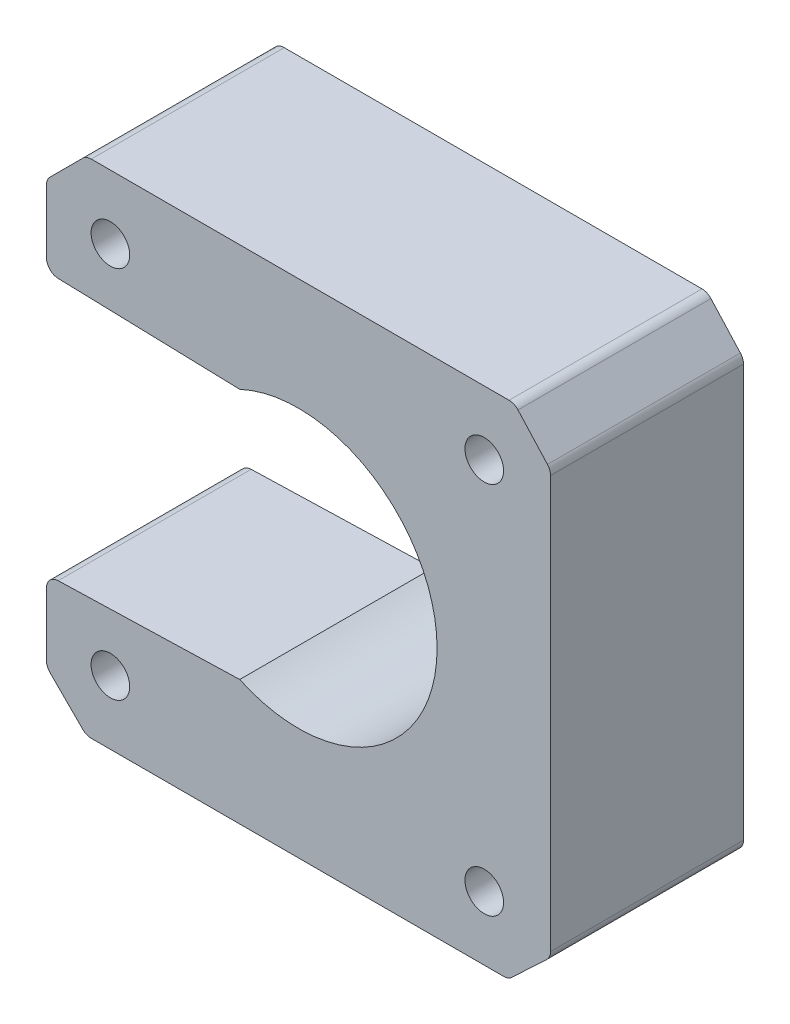
ISO-10303-21;
HEADER;
FILE_DESCRIPTION(('STEP AP214'),'2;1');
FILE_NAME('part.step','',(''),(''),'','','');
FILE_SCHEMA(('AUTOMOTIVE_DESIGN { 1 0 10303 214 1 1 1 1 }'));
ENDSEC;
DATA;
#1=APPLICATION_CONTEXT('core data for automotive mechanical design processes');
#2=APPLICATION_PROTOCOL_DEFINITION('international standard','automotive_design',2000,#1);
#3=PRODUCT_CONTEXT('',#1,'mechanical');
#4=PRODUCT('Part','Part','',(#3));
#5=PRODUCT_RELATED_PRODUCT_CATEGORY('part','',(#4));
#6=PRODUCT_DEFINITION_FORMATION('','',#4);
#7=PRODUCT_DEFINITION_CONTEXT('part definition',#1,'design');
#8=PRODUCT_DEFINITION('design','',#6,#7);
#9=PRODUCT_DEFINITION_SHAPE('','',#8);
#10=(LENGTH_UNIT() NAMED_UNIT(*) SI_UNIT(.MILLI.,.METRE.));
#11=(NAMED_UNIT(*) PLANE_ANGLE_UNIT() SI_UNIT($,.RADIAN.));
#12=(NAMED_UNIT(*) SI_UNIT($,.STERADIAN.) SOLID_ANGLE_UNIT());
#13=UNCERTAINTY_MEASURE_WITH_UNIT(LENGTH_MEASURE(1.E-05),#10,'distance_accuracy_value','');
#14=(GEOMETRIC_REPRESENTATION_CONTEXT(3) GLOBAL_UNCERTAINTY_ASSIGNED_CONTEXT((#13)) GLOBAL_UNIT_ASSIGNED_CONTEXT((#10,
#11,#12)) REPRESENTATION_CONTEXT('',''));
#15=CARTESIAN_POINT('',(0.,0.,0.));
#16=DIRECTION('',(0.,0.,1.));
#17=DIRECTION('',(1.,0.,0.));
#18=AXIS2_PLACEMENT_3D('',#15,#16,#17);
#19=CARTESIAN_POINT('',(1.20000000298024,38.0857864376269,0.));
#20=DIRECTION('',(0.,0.,-1.));
#21=DIRECTION('',(-1.,0.,0.));
#22=AXIS2_PLACEMENT_3D('',#19,#20,#21);
#23=CYLINDRICAL_SURFACE('',#22,1.00000000000001);
#24=CARTESIAN_POINT('',(1.20000000298024,38.0857864376269,-16.));
#25=DIRECTION('',(0.,0.,-1.));
#26=DIRECTION('',(-1.,0.,0.));
#27=AXIS2_PLACEMENT_3D('',#24,#25,#26);
#28=CIRCLE('',#27,1.00000000000001);
#29=CARTESIAN_POINT('',(0.200000002980233,38.0857864376269,-16.));
#30=VERTEX_POINT('',#29);
#31=CARTESIAN_POINT('',(0.492893221793694,38.7928932188134,-16.));
#32=VERTEX_POINT('',#31);
#33=EDGE_CURVE('E317',#30,#32,#28,.T.);
#34=ORIENTED_EDGE('',*,*,#33,.F.);
#35=DIRECTION('',(0.,0.,1.));
#36=VECTOR('',#35,1.);
#37=CARTESIAN_POINT('',(0.200000002980233,38.0857864376269,0.));
#38=LINE('',#37,#36);
#39=CARTESIAN_POINT('',(0.200000002980231,38.0857864376269,0.));
#40=VERTEX_POINT('',#39);
#41=EDGE_CURVE('E169',#40,#30,#38,.F.);
#42=ORIENTED_EDGE('',*,*,#41,.F.);
#43=CARTESIAN_POINT('',(1.20000000298024,38.0857864376269,0.));
#44=DIRECTION('',(0.,0.,-1.));
#45=DIRECTION('',(-1.,0.,0.));
#46=AXIS2_PLACEMENT_3D('',#43,#44,#45);
#47=CIRCLE('',#46,1.00000000000001);
#48=CARTESIAN_POINT('',(0.492893221793693,38.7928932188134,0.));
#49=VERTEX_POINT('',#48);
#50=EDGE_CURVE('E19',#40,#49,#47,.T.);
#51=ORIENTED_EDGE('',*,*,#50,.T.);
#52=DIRECTION('',(0.,0.,1.));
#53=VECTOR('',#52,1.);
#54=CARTESIAN_POINT('',(0.492893221793678,38.7928932188134,0.));
#55=LINE('',#54,#53);
#56=EDGE_CURVE('E168',#32,#49,#55,.T.);
#57=ORIENTED_EDGE('',*,*,#56,.F.);
#58=EDGE_LOOP('',(#34,#42,#51,#57));
#59=FACE_BOUND('',#58,.T.);
#60=ADVANCED_FACE('F16',(#59),#23,.T.);
#61=CARTESIAN_POINT('',(3.91421356237309,40.7999999970199,0.));
#62=DIRECTION('',(0.,0.,-1.));
#63=DIRECTION('',(-1.,0.,0.));
#64=AXIS2_PLACEMENT_3D('',#61,#62,#63);
#65=CYLINDRICAL_SURFACE('',#64,0.999999999999935);
#66=CARTESIAN_POINT('',(3.91421356237309,40.7999999970199,-16.));
#67=DIRECTION('',(0.,0.,-1.));
#68=DIRECTION('',(-1.,0.,0.));
#69=AXIS2_PLACEMENT_3D('',#66,#67,#68);
#70=CIRCLE('',#69,0.999999999999935);
#71=CARTESIAN_POINT('',(3.2071067811866,41.5071067782063,-16.));
#72=VERTEX_POINT('',#71);
#73=CARTESIAN_POINT('',(3.91421356237307,41.7999999970198,-16.));
#74=VERTEX_POINT('',#73);
#75=EDGE_CURVE('E315',#72,#74,#70,.T.);
#76=ORIENTED_EDGE('',*,*,#75,.F.);
#77=DIRECTION('',(0.,0.,1.));
#78=VECTOR('',#77,1.);
#79=CARTESIAN_POINT('',(3.20710678118657,41.5071067782063,0.));
#80=LINE('',#79,#78);
#81=CARTESIAN_POINT('',(3.20710678118659,41.5071067782063,0.));
#82=VERTEX_POINT('',#81);
#83=EDGE_CURVE('E249',#82,#72,#80,.F.);
#84=ORIENTED_EDGE('',*,*,#83,.F.);
#85=CARTESIAN_POINT('',(3.91421356237309,40.7999999970199,0.));
#86=DIRECTION('',(0.,0.,-1.));
#87=DIRECTION('',(-1.,0.,0.));
#88=AXIS2_PLACEMENT_3D('',#85,#86,#87);
#89=CIRCLE('',#88,0.999999999999935);
#90=CARTESIAN_POINT('',(3.91421356237307,41.7999999970198,0.));
#91=VERTEX_POINT('',#90);
#92=EDGE_CURVE('E171',#82,#91,#89,.T.);
#93=ORIENTED_EDGE('',*,*,#92,.T.);
#94=DIRECTION('',(0.,0.,1.));
#95=VECTOR('',#94,1.);
#96=CARTESIAN_POINT('',(3.91421356237304,41.7999999970198,0.));
#97=LINE('',#96,#95);
#98=EDGE_CURVE('E244',#74,#91,#97,.T.);
#99=ORIENTED_EDGE('',*,*,#98,.F.);
#100=EDGE_LOOP('',(#76,#84,#93,#99));
#101=FACE_BOUND('',#100,.T.);
#102=ADVANCED_FACE('F339',(#101),#65,.T.);
#103=CARTESIAN_POINT('',(38.5576301208605,40.7999999970198,0.));
#104=DIRECTION('',(0.,0.,-1.));
#105=DIRECTION('',(-1.,0.,0.));
#106=AXIS2_PLACEMENT_3D('',#103,#104,#105);
#107=CYLINDRICAL_SURFACE('',#106,1.00000000000001);
#108=CARTESIAN_POINT('',(38.5576301208605,40.7999999970198,-16.));
#109=DIRECTION('',(0.,0.,-1.));
#110=DIRECTION('',(-1.,0.,0.));
#111=AXIS2_PLACEMENT_3D('',#108,#109,#110);
#112=CIRCLE('',#111,1.00000000000001);
#113=CARTESIAN_POINT('',(38.5576301208605,41.7999999970198,-16.));
#114=VERTEX_POINT('',#113);
#115=CARTESIAN_POINT('',(39.2975701947855,41.4726727904341,-16.));
#116=VERTEX_POINT('',#115);
#117=EDGE_CURVE('E313',#114,#116,#112,.T.);
#118=ORIENTED_EDGE('',*,*,#117,.F.);
#119=DIRECTION('',(0.,0.,1.));
#120=VECTOR('',#119,1.);
#121=CARTESIAN_POINT('',(38.5576301208605,41.7999999970198,0.));
#122=LINE('',#121,#120);
#123=CARTESIAN_POINT('',(38.5576301208605,41.7999999970198,0.));
#124=VERTEX_POINT('',#123);
#125=EDGE_CURVE('E179',#124,#114,#122,.F.);
#126=ORIENTED_EDGE('',*,*,#125,.F.);
#127=CARTESIAN_POINT('',(38.5576301208605,40.7999999970198,0.));
#128=DIRECTION('',(0.,0.,-1.));
#129=DIRECTION('',(-1.,0.,0.));
#130=AXIS2_PLACEMENT_3D('',#127,#128,#129);
#131=CIRCLE('',#130,1.00000000000001);
#132=CARTESIAN_POINT('',(39.2975701947855,41.4726727904341,0.));
#133=VERTEX_POINT('',#132);
#134=EDGE_CURVE('E335',#124,#133,#131,.T.);
#135=ORIENTED_EDGE('',*,*,#134,.T.);
#136=DIRECTION('',(0.,0.,1.));
#137=VECTOR('',#136,1.);
#138=CARTESIAN_POINT('',(39.2975701947855,41.4726727904341,0.));
#139=LINE('',#138,#137);
#140=EDGE_CURVE('E238',#116,#133,#139,.T.);
#141=ORIENTED_EDGE('',*,*,#140,.F.);
#142=EDGE_LOOP('',(#118,#126,#135,#141));
#143=FACE_BOUND('',#142,.T.);
#144=ADVANCED_FACE('F349',(#143),#107,.T.);
#145=CARTESIAN_POINT('',(41.0000000000001,38.1133931257203,0.));
#146=DIRECTION('',(0.,0.,-1.));
#147=DIRECTION('',(-1.,0.,0.));
#148=AXIS2_PLACEMENT_3D('',#145,#146,#147);
#149=CYLINDRICAL_SURFACE('',#148,1.00000000000003);
#150=CARTESIAN_POINT('',(41.0000000000001,38.1133931257203,-16.));
#151=DIRECTION('',(0.,0.,-1.));
#152=DIRECTION('',(-1.,0.,0.));
#153=AXIS2_PLACEMENT_3D('',#150,#151,#152);
#154=CIRCLE('',#153,1.00000000000003);
#155=CARTESIAN_POINT('',(41.7399400739251,38.7860659191346,-16.));
#156=VERTEX_POINT('',#155);
#157=CARTESIAN_POINT('',(42.0000000000001,38.1133931257203,-16.));
#158=VERTEX_POINT('',#157);
#159=EDGE_CURVE('E311',#156,#158,#154,.T.);
#160=ORIENTED_EDGE('',*,*,#159,.F.);
#161=DIRECTION('',(0.,0.,1.));
#162=VECTOR('',#161,1.);
#163=CARTESIAN_POINT('',(41.7399400739251,38.7860659191346,0.));
#164=LINE('',#163,#162);
#165=CARTESIAN_POINT('',(41.7399400739251,38.7860659191346,0.));
#166=VERTEX_POINT('',#165);
#167=EDGE_CURVE('E242',#166,#156,#164,.F.);
#168=ORIENTED_EDGE('',*,*,#167,.F.);
#169=CARTESIAN_POINT('',(41.0000000000001,38.1133931257203,0.));
#170=DIRECTION('',(0.,0.,-1.));
#171=DIRECTION('',(-1.,0.,0.));
#172=AXIS2_PLACEMENT_3D('',#169,#170,#171);
#173=CIRCLE('',#172,1.00000000000003);
#174=CARTESIAN_POINT('',(42.0000000000001,38.1133931257203,0.));
#175=VERTEX_POINT('',#174);
#176=EDGE_CURVE('E333',#166,#175,#173,.T.);
#177=ORIENTED_EDGE('',*,*,#176,.T.);
#178=DIRECTION('',(0.,0.,1.));
#179=VECTOR('',#178,1.);
#180=CARTESIAN_POINT('',(42.0000000000001,38.1133931257202,0.));
#181=LINE('',#180,#179);
#182=EDGE_CURVE('E232',#158,#175,#181,.T.);
#183=ORIENTED_EDGE('',*,*,#182,.F.);
#184=EDGE_LOOP('',(#160,#168,#177,#183));
#185=FACE_BOUND('',#184,.T.);
#186=ADVANCED_FACE('F399',(#185),#149,.T.);
#187=CARTESIAN_POINT('',(41.,3.93154439693087,0.));
#188=DIRECTION('',(0.,0.,-1.));
#189=DIRECTION('',(-1.,0.,0.));
#190=AXIS2_PLACEMENT_3D('',#187,#188,#189);
#191=CYLINDRICAL_SURFACE('',#190,0.99999999999997);
#192=CARTESIAN_POINT('',(41.,3.93154439693087,-16.));
#193=DIRECTION('',(0.,0.,-1.));
#194=DIRECTION('',(-1.,0.,0.));
#195=AXIS2_PLACEMENT_3D('',#192,#193,#194);
#196=CIRCLE('',#195,0.99999999999997);
#197=CARTESIAN_POINT('',(41.9999999999999,3.93154439693087,-16.));
#198=VERTEX_POINT('',#197);
#199=CARTESIAN_POINT('',(41.686012868361,3.20395499043635,-16.));
#200=VERTEX_POINT('',#199);
#201=EDGE_CURVE('E309',#198,#200,#196,.T.);
#202=ORIENTED_EDGE('',*,*,#201,.F.);
#203=DIRECTION('',(0.,0.,1.));
#204=VECTOR('',#203,1.);
#205=CARTESIAN_POINT('',(41.9999999999999,3.93154439693088,0.));
#206=LINE('',#205,#204);
#207=CARTESIAN_POINT('',(42.,3.93154439693087,0.));
#208=VERTEX_POINT('',#207);
#209=EDGE_CURVE('E236',#208,#198,#206,.F.);
#210=ORIENTED_EDGE('',*,*,#209,.F.);
#211=CARTESIAN_POINT('',(41.,3.93154439693087,0.));
#212=DIRECTION('',(0.,0.,-1.));
#213=DIRECTION('',(-1.,0.,0.));
#214=AXIS2_PLACEMENT_3D('',#211,#212,#213);
#215=CIRCLE('',#214,0.99999999999997);
#216=CARTESIAN_POINT('',(41.686012868361,3.20395499043635,0.));
#217=VERTEX_POINT('',#216);
#218=EDGE_CURVE('E331',#208,#217,#215,.T.);
#219=ORIENTED_EDGE('',*,*,#218,.T.);
#220=DIRECTION('',(0.,0.,1.));
#221=VECTOR('',#220,1.);
#222=CARTESIAN_POINT('',(41.686012868361,3.20395499043634,0.));
#223=LINE('',#222,#221);
#224=EDGE_CURVE('E226',#200,#217,#223,.T.);
#225=ORIENTED_EDGE('',*,*,#224,.F.);
#226=EDGE_LOOP('',(#202,#210,#219,#225));
#227=FACE_BOUND('',#226,.T.);
#228=ADVANCED_FACE('F403',(#227),#191,.T.);
#229=CARTESIAN_POINT('',(38.1029074583451,1.20000000298024,0.));
#230=DIRECTION('',(0.,0.,-1.));
#231=DIRECTION('',(-1.,0.,0.));
#232=AXIS2_PLACEMENT_3D('',#229,#230,#231);
#233=CYLINDRICAL_SURFACE('',#232,1.00000000000001);
#234=CARTESIAN_POINT('',(38.1029074583451,1.20000000298024,-16.));
#235=DIRECTION('',(0.,0.,-1.));
#236=DIRECTION('',(-1.,0.,0.));
#237=AXIS2_PLACEMENT_3D('',#234,#235,#236);
#238=CIRCLE('',#237,1.00000000000001);
#239=CARTESIAN_POINT('',(38.7889203267061,0.472410596485713,-16.));
#240=VERTEX_POINT('',#239);
#241=CARTESIAN_POINT('',(38.1029074583451,0.200000002980231,-16.));
#242=VERTEX_POINT('',#241);
#243=EDGE_CURVE('E307',#240,#242,#238,.T.);
#244=ORIENTED_EDGE('',*,*,#243,.F.);
#245=DIRECTION('',(0.,0.,1.));
#246=VECTOR('',#245,1.);
#247=CARTESIAN_POINT('',(38.7889203267061,0.472410596485702,0.));
#248=LINE('',#247,#246);
#249=CARTESIAN_POINT('',(38.7889203267061,0.47241059648571,0.));
#250=VERTEX_POINT('',#249);
#251=EDGE_CURVE('E230',#250,#240,#248,.F.);
#252=ORIENTED_EDGE('',*,*,#251,.F.);
#253=CARTESIAN_POINT('',(38.1029074583451,1.20000000298024,0.));
#254=DIRECTION('',(0.,0.,-1.));
#255=DIRECTION('',(-1.,0.,0.));
#256=AXIS2_PLACEMENT_3D('',#253,#254,#255);
#257=CIRCLE('',#256,1.00000000000001);
#258=CARTESIAN_POINT('',(38.1029074583451,0.20000000298023,0.));
#259=VERTEX_POINT('',#258);
#260=EDGE_CURVE('E329',#250,#259,#257,.T.);
#261=ORIENTED_EDGE('',*,*,#260,.T.);
#262=DIRECTION('',(0.,0.,1.));
#263=VECTOR('',#262,1.);
#264=CARTESIAN_POINT('',(38.1029074583451,0.200000002980231,0.));
#265=LINE('',#264,#263);
#266=EDGE_CURVE('E220',#242,#259,#265,.T.);
#267=ORIENTED_EDGE('',*,*,#266,.F.);
#268=EDGE_LOOP('',(#244,#252,#261,#267));
#269=FACE_BOUND('',#268,.T.);
#270=ADVANCED_FACE('F411',(#269),#233,.T.);
#271=CARTESIAN_POINT('',(3.91421356237309,1.20000000298021,0.));
#272=DIRECTION('',(0.,0.,-1.));
#273=DIRECTION('',(-1.,0.,0.));
#274=AXIS2_PLACEMENT_3D('',#271,#272,#273);
#275=CYLINDRICAL_SURFACE('',#274,0.999999999999982);
#276=CARTESIAN_POINT('',(3.91421356237309,1.20000000298021,-16.));
#277=DIRECTION('',(0.,0.,-1.));
#278=DIRECTION('',(-1.,0.,0.));
#279=AXIS2_PLACEMENT_3D('',#276,#277,#278);
#280=CIRCLE('',#279,0.999999999999982);
#281=CARTESIAN_POINT('',(3.91421356237308,0.200000002980233,-16.));
#282=VERTEX_POINT('',#281);
#283=CARTESIAN_POINT('',(3.20710678118656,0.492893221793676,-16.));
#284=VERTEX_POINT('',#283);
#285=EDGE_CURVE('E305',#282,#284,#280,.T.);
#286=ORIENTED_EDGE('',*,*,#285,.F.);
#287=DIRECTION('',(0.,0.,1.));
#288=VECTOR('',#287,1.);
#289=CARTESIAN_POINT('',(3.91421356237307,0.200000002980233,0.));
#290=LINE('',#289,#288);
#291=CARTESIAN_POINT('',(3.91421356237308,0.200000002980231,0.));
#292=VERTEX_POINT('',#291);
#293=EDGE_CURVE('E224',#292,#282,#290,.F.);
#294=ORIENTED_EDGE('',*,*,#293,.F.);
#295=CARTESIAN_POINT('',(3.91421356237309,1.20000000298021,0.));
#296=DIRECTION('',(0.,0.,-1.));
#297=DIRECTION('',(-1.,0.,0.));
#298=AXIS2_PLACEMENT_3D('',#295,#296,#297);
#299=CIRCLE('',#298,0.999999999999982);
#300=CARTESIAN_POINT('',(3.20710678118656,0.492893221793676,0.));
#301=VERTEX_POINT('',#300);
#302=EDGE_CURVE('E327',#292,#301,#299,.T.);
#303=ORIENTED_EDGE('',*,*,#302,.T.);
#304=DIRECTION('',(0.,0.,1.));
#305=VECTOR('',#304,1.);
#306=CARTESIAN_POINT('',(3.20710678118656,0.492893221793676,0.));
#307=LINE('',#306,#305);
#308=EDGE_CURVE('E214',#284,#301,#307,.T.);
#309=ORIENTED_EDGE('',*,*,#308,.F.);
#310=EDGE_LOOP('',(#286,#294,#303,#309));
#311=FACE_BOUND('',#310,.T.);
#312=ADVANCED_FACE('F420',(#311),#275,.T.);
#313=CARTESIAN_POINT('',(1.20000000298022,3.91421356237309,0.));
#314=DIRECTION('',(0.,0.,-1.));
#315=DIRECTION('',(-1.,0.,0.));
#316=AXIS2_PLACEMENT_3D('',#313,#314,#315);
#317=CYLINDRICAL_SURFACE('',#316,0.99999999999999);
#318=CARTESIAN_POINT('',(1.20000000298022,3.91421356237309,-16.));
#319=DIRECTION('',(0.,0.,-1.));
#320=DIRECTION('',(-1.,0.,0.));
#321=AXIS2_PLACEMENT_3D('',#318,#319,#320);
#322=CIRCLE('',#321,0.99999999999999);
#323=CARTESIAN_POINT('',(0.492893221793689,3.20710678118655,-16.));
#324=VERTEX_POINT('',#323);
#325=CARTESIAN_POINT('',(0.200000002980232,3.91421356237309,-16.));
#326=VERTEX_POINT('',#325);
#327=EDGE_CURVE('E303',#324,#326,#322,.T.);
#328=ORIENTED_EDGE('',*,*,#327,.F.);
#329=DIRECTION('',(0.,0.,1.));
#330=VECTOR('',#329,1.);
#331=CARTESIAN_POINT('',(0.492893221793696,3.20710678118654,0.));
#332=LINE('',#331,#330);
#333=CARTESIAN_POINT('',(0.492893221793689,3.20710678118655,0.));
#334=VERTEX_POINT('',#333);
#335=EDGE_CURVE('E218',#334,#324,#332,.F.);
#336=ORIENTED_EDGE('',*,*,#335,.F.);
#337=CARTESIAN_POINT('',(1.20000000298022,3.91421356237309,0.));
#338=DIRECTION('',(0.,0.,-1.));
#339=DIRECTION('',(-1.,0.,0.));
#340=AXIS2_PLACEMENT_3D('',#337,#338,#339);
#341=CIRCLE('',#340,0.99999999999999);
#342=CARTESIAN_POINT('',(0.200000002980232,3.91421356237309,0.));
#343=VERTEX_POINT('',#342);
#344=EDGE_CURVE('E325',#334,#343,#341,.T.);
#345=ORIENTED_EDGE('',*,*,#344,.T.);
#346=DIRECTION('',(0.,0.,1.));
#347=VECTOR('',#346,1.);
#348=CARTESIAN_POINT('',(0.200000002980232,3.91421356237309,0.));
#349=LINE('',#348,#347);
#350=EDGE_CURVE('E208',#326,#343,#349,.T.);
#351=ORIENTED_EDGE('',*,*,#350,.F.);
#352=EDGE_LOOP('',(#328,#336,#345,#351));
#353=FACE_BOUND('',#352,.T.);
#354=ADVANCED_FACE('F429',(#353),#317,.T.);
#355=CARTESIAN_POINT('',(1.20000000298015,9.14879205829702,0.));
#356=DIRECTION('',(0.,0.,-1.));
#357=DIRECTION('',(-1.,0.,0.));
#358=AXIS2_PLACEMENT_3D('',#355,#356,#357);
#359=CYLINDRICAL_SURFACE('',#358,0.999999999999916);
#360=CARTESIAN_POINT('',(1.20000000298015,9.14879205829702,-16.));
#361=DIRECTION('',(0.,0.,-1.));
#362=DIRECTION('',(-1.,0.,0.));
#363=AXIS2_PLACEMENT_3D('',#360,#361,#362);
#364=CIRCLE('',#363,0.999999999999916);
#365=CARTESIAN_POINT('',(0.200000002980232,9.14879205829702,-16.));
#366=VERTEX_POINT('',#365);
#367=CARTESIAN_POINT('',(1.17131880358903,10.1483806680768,-16.));
#368=VERTEX_POINT('',#367);
#369=EDGE_CURVE('E256',#366,#368,#364,.T.);
#370=ORIENTED_EDGE('',*,*,#369,.F.);
#371=DIRECTION('',(0.,0.,1.));
#372=VECTOR('',#371,1.);
#373=CARTESIAN_POINT('',(0.200000002980232,9.14879205829702,0.));
#374=LINE('',#373,#372);
#375=CARTESIAN_POINT('',(0.200000002980233,9.14879205829702,0.));
#376=VERTEX_POINT('',#375);
#377=EDGE_CURVE('E212',#376,#366,#374,.F.);
#378=ORIENTED_EDGE('',*,*,#377,.F.);
#379=CARTESIAN_POINT('',(1.20000000298015,9.14879205829702,0.));
#380=DIRECTION('',(0.,0.,-1.));
#381=DIRECTION('',(-1.,0.,0.));
#382=AXIS2_PLACEMENT_3D('',#379,#380,#381);
#383=CIRCLE('',#382,0.999999999999916);
#384=CARTESIAN_POINT('',(1.17131880358903,10.1483806680768,0.));
#385=VERTEX_POINT('',#384);
#386=EDGE_CURVE('E323',#376,#385,#383,.T.);
#387=ORIENTED_EDGE('',*,*,#386,.T.);
#388=DIRECTION('',(0.,0.,1.));
#389=VECTOR('',#388,1.);
#390=CARTESIAN_POINT('',(1.17131880358907,10.1483806680768,0.));
#391=LINE('',#390,#389);
#392=EDGE_CURVE('E204',#368,#385,#391,.T.);
#393=ORIENTED_EDGE('',*,*,#392,.F.);
#394=EDGE_LOOP('',(#370,#378,#387,#393));
#395=FACE_BOUND('',#394,.T.);
#396=ADVANCED_FACE('F437',(#395),#359,.T.);
#397=CARTESIAN_POINT('',(1.20000000298022,32.851207941703,0.));
#398=DIRECTION('',(0.,0.,-1.));
#399=DIRECTION('',(-1.,0.,0.));
#400=AXIS2_PLACEMENT_3D('',#397,#398,#399);
#401=CYLINDRICAL_SURFACE('',#400,0.999999999999992);
#402=CARTESIAN_POINT('',(1.20000000298022,32.851207941703,-16.));
#403=DIRECTION('',(0.,0.,-1.));
#404=DIRECTION('',(-1.,0.,0.));
#405=AXIS2_PLACEMENT_3D('',#402,#403,#404);
#406=CIRCLE('',#405,0.999999999999992);
#407=CARTESIAN_POINT('',(1.17131880358905,31.8516193319232,-16.));
#408=VERTEX_POINT('',#407);
#409=CARTESIAN_POINT('',(0.20000000298023,32.851207941703,-16.));
#410=VERTEX_POINT('',#409);
#411=EDGE_CURVE('E319',#408,#410,#406,.T.);
#412=ORIENTED_EDGE('',*,*,#411,.F.);
#413=DIRECTION('',(0.,0.,1.));
#414=VECTOR('',#413,1.);
#415=CARTESIAN_POINT('',(1.17131880358905,31.8516193319232,0.));
#416=LINE('',#415,#414);
#417=CARTESIAN_POINT('',(1.17131880358905,31.8516193319233,0.));
#418=VERTEX_POINT('',#417);
#419=EDGE_CURVE('E198',#418,#408,#416,.F.);
#420=ORIENTED_EDGE('',*,*,#419,.F.);
#421=CARTESIAN_POINT('',(1.20000000298022,32.851207941703,0.));
#422=DIRECTION('',(0.,0.,-1.));
#423=DIRECTION('',(-1.,0.,0.));
#424=AXIS2_PLACEMENT_3D('',#421,#422,#423);
#425=CIRCLE('',#424,0.999999999999992);
#426=CARTESIAN_POINT('',(0.20000000298023,32.851207941703,0.));
#427=VERTEX_POINT('',#426);
#428=EDGE_CURVE('E321',#418,#427,#425,.T.);
#429=ORIENTED_EDGE('',*,*,#428,.T.);
#430=DIRECTION('',(0.,0.,1.));
#431=VECTOR('',#430,1.);
#432=CARTESIAN_POINT('',(0.20000000298023,32.851207941703,0.));
#433=LINE('',#432,#431);
#434=EDGE_CURVE('E251',#410,#427,#433,.T.);
#435=ORIENTED_EDGE('',*,*,#434,.F.);
#436=EDGE_LOOP('',(#412,#420,#429,#435));
#437=FACE_BOUND('',#436,.T.);
#438=ADVANCED_FACE('F360',(#437),#401,.T.);
#439=CARTESIAN_POINT('',(21.1000000014902,21.,-16.));
#440=DIRECTION('',(0.,0.,-1.));
#441=DIRECTION('',(-1.,0.,0.));
#442=AXIS2_PLACEMENT_3D('',#439,#440,#441);
#443=PLANE('',#442);
#444=CARTESIAN_POINT('',(5.5,36.5,-16.));
#445=DIRECTION('',(0.,0.,-1.));
#446=DIRECTION('',(-1.,0.,0.));
#447=AXIS2_PLACEMENT_3D('',#444,#445,#446);
#448=CIRCLE('',#447,1.6);
#449=CARTESIAN_POINT('',(3.9,36.5,-16.));
#450=VERTEX_POINT('',#449);
#451=EDGE_CURVE('E191',#450,#450,#448,.F.);
#452=ORIENTED_EDGE('',*,*,#451,.T.);
#453=EDGE_LOOP('',(#452));
#454=FACE_BOUND('',#453,.T.);
#455=CARTESIAN_POINT('',(36.5,36.5,-16.));
#456=DIRECTION('',(0.,0.,-1.));
#457=DIRECTION('',(-1.,0.,0.));
#458=AXIS2_PLACEMENT_3D('',#455,#456,#457);
#459=CIRCLE('',#458,1.60000000000001);
#460=CARTESIAN_POINT('',(34.9,36.5,-16.));
#461=VERTEX_POINT('',#460);
#462=EDGE_CURVE('E292',#461,#461,#459,.F.);
#463=ORIENTED_EDGE('',*,*,#462,.T.);
#464=EDGE_LOOP('',(#463));
#465=FACE_BOUND('',#464,.T.);
#466=CARTESIAN_POINT('',(5.5,5.5,-16.));
#467=DIRECTION('',(0.,0.,-1.));
#468=DIRECTION('',(-1.,0.,0.));
#469=AXIS2_PLACEMENT_3D('',#466,#467,#468);
#470=CIRCLE('',#469,1.6);
#471=CARTESIAN_POINT('',(3.9,5.5,-16.));
#472=VERTEX_POINT('',#471);
#473=EDGE_CURVE('E295',#472,#472,#470,.F.);
#474=ORIENTED_EDGE('',*,*,#473,.T.);
#475=EDGE_LOOP('',(#474));
#476=FACE_BOUND('',#475,.T.);
#477=CARTESIAN_POINT('',(36.5,5.5,-16.));
#478=DIRECTION('',(0.,0.,-1.));
#479=DIRECTION('',(-1.,0.,0.));
#480=AXIS2_PLACEMENT_3D('',#477,#478,#479);
#481=CIRCLE('',#480,1.60000000000001);
#482=CARTESIAN_POINT('',(34.9,5.5,-16.));
#483=VERTEX_POINT('',#482);
#484=EDGE_CURVE('E196',#483,#483,#481,.F.);
#485=ORIENTED_EDGE('',*,*,#484,.T.);
#486=EDGE_LOOP('',(#485));
#487=FACE_BOUND('',#486,.T.);
#488=DIRECTION('',(-0.999588609779786,-0.0286811993911593,0.));
#489=VECTOR('',#488,1.);
#490=CARTESIAN_POINT('',(1.17131880358907,10.1483806680768,-16.));
#491=LINE('',#490,#489);
#492=CARTESIAN_POINT('',(16.2242648728231,10.5802949010043,-16.));
#493=VERTEX_POINT('',#492);
#494=EDGE_CURVE('E207',#493,#368,#491,.T.);
#495=ORIENTED_EDGE('',*,*,#494,.F.);
#496=CARTESIAN_POINT('',(21.0904487626861,21.,-16.));
#497=DIRECTION('',(0.,0.,-1.));
#498=DIRECTION('',(-1.,0.,0.));
#499=AXIS2_PLACEMENT_3D('',#496,#497,#498);
#500=CIRCLE('',#499,11.5);
#501=CARTESIAN_POINT('',(16.2242648728231,31.4197050989957,-16.));
#502=VERTEX_POINT('',#501);
#503=EDGE_CURVE('E200',#493,#502,#500,.F.);
#504=ORIENTED_EDGE('',*,*,#503,.T.);
#505=DIRECTION('',(0.999588609779786,-0.0286811993911638,0.));
#506=VECTOR('',#505,1.);
#507=CARTESIAN_POINT('',(16.2242648728231,31.4197050989957,-16.));
#508=LINE('',#507,#506);
#509=EDGE_CURVE('E197',#408,#502,#508,.T.);
#510=ORIENTED_EDGE('',*,*,#509,.F.);
#511=ORIENTED_EDGE('',*,*,#411,.T.);
#512=DIRECTION('',(0.,-1.,0.));
#513=VECTOR('',#512,1.);
#514=CARTESIAN_POINT('',(0.20000000298023,32.851207941703,-16.));
#515=LINE('',#514,#513);
#516=EDGE_CURVE('E254',#30,#410,#515,.T.);
#517=ORIENTED_EDGE('',*,*,#516,.F.);
#518=ORIENTED_EDGE('',*,*,#33,.T.);
#519=DIRECTION('',(-0.707106781186547,-0.707106781186548,0.));
#520=VECTOR('',#519,1.);
#521=CARTESIAN_POINT('',(0.492893221793678,38.7928932188134,-16.));
#522=LINE('',#521,#520);
#523=EDGE_CURVE('E178',#72,#32,#522,.T.);
#524=ORIENTED_EDGE('',*,*,#523,.F.);
#525=ORIENTED_EDGE('',*,*,#75,.T.);
#526=DIRECTION('',(1.,0.,0.));
#527=VECTOR('',#526,1.);
#528=CARTESIAN_POINT('',(3.91421356237304,41.7999999970198,-16.));
#529=LINE('',#528,#527);
#530=EDGE_CURVE('E247',#114,#74,#529,.F.);
#531=ORIENTED_EDGE('',*,*,#530,.F.);
#532=ORIENTED_EDGE('',*,*,#117,.T.);
#533=DIRECTION('',(-0.672672793414259,0.739940073925084,0.));
#534=VECTOR('',#533,1.);
#535=CARTESIAN_POINT('',(39.2975701947855,41.4726727904341,-16.));
#536=LINE('',#535,#534);
#537=EDGE_CURVE('E241',#156,#116,#536,.T.);
#538=ORIENTED_EDGE('',*,*,#537,.F.);
#539=ORIENTED_EDGE('',*,*,#159,.T.);
#540=DIRECTION('',(0.,1.,0.));
#541=VECTOR('',#540,1.);
#542=CARTESIAN_POINT('',(42.0000000000001,38.1133931257202,-16.));
#543=LINE('',#542,#541);
#544=EDGE_CURVE('E235',#198,#158,#543,.T.);
#545=ORIENTED_EDGE('',*,*,#544,.F.);
#546=ORIENTED_EDGE('',*,*,#201,.T.);
#547=DIRECTION('',(0.727589406494538,0.686012868361029,0.));
#548=VECTOR('',#547,1.);
#549=CARTESIAN_POINT('',(41.686012868361,3.20395499043634,-16.));
#550=LINE('',#549,#548);
#551=EDGE_CURVE('E229',#240,#200,#550,.T.);
#552=ORIENTED_EDGE('',*,*,#551,.F.);
#553=ORIENTED_EDGE('',*,*,#243,.T.);
#554=DIRECTION('',(1.,0.,0.));
#555=VECTOR('',#554,1.);
#556=CARTESIAN_POINT('',(38.1029074583451,0.200000002980231,-16.));
#557=LINE('',#556,#555);
#558=EDGE_CURVE('E223',#282,#242,#557,.T.);
#559=ORIENTED_EDGE('',*,*,#558,.F.);
#560=ORIENTED_EDGE('',*,*,#285,.T.);
#561=DIRECTION('',(0.707106781186547,-0.707106781186548,0.));
#562=VECTOR('',#561,1.);
#563=CARTESIAN_POINT('',(3.20710678118655,0.492893221793681,-16.));
#564=LINE('',#563,#562);
#565=EDGE_CURVE('E217',#324,#284,#564,.T.);
#566=ORIENTED_EDGE('',*,*,#565,.F.);
#567=ORIENTED_EDGE('',*,*,#327,.T.);
#568=DIRECTION('',(0.,-1.,0.));
#569=VECTOR('',#568,1.);
#570=CARTESIAN_POINT('',(0.200000002980232,3.91421356237309,-16.));
#571=LINE('',#570,#569);
#572=EDGE_CURVE('E211',#366,#326,#571,.T.);
#573=ORIENTED_EDGE('',*,*,#572,.F.);
#574=ORIENTED_EDGE('',*,*,#369,.T.);
#575=EDGE_LOOP('',(#495,#504,#510,#511,#517,#518,#524,#525,#531,#532,#538,#539,#545,#546,#552,
#553,#559,#560,#566,#567,#573,#574));
#576=FACE_BOUND('',#575,.T.);
#577=ADVANCED_FACE('F352',(#454,#465,#476,#487,#576),#443,.T.);
#578=CARTESIAN_POINT('',(0.20000000298023,32.851207941703,0.));
#579=DIRECTION('',(-1.,0.,0.));
#580=DIRECTION('',(0.,-1.,0.));
#581=AXIS2_PLACEMENT_3D('',#578,#579,#580);
#582=PLANE('',#581);
#583=ORIENTED_EDGE('',*,*,#516,.T.);
#584=ORIENTED_EDGE('',*,*,#434,.T.);
#585=DIRECTION('',(0.,1.,0.));
#586=VECTOR('',#585,1.);
#587=CARTESIAN_POINT('',(0.200000002980229,21.,0.));
#588=LINE('',#587,#586);
#589=EDGE_CURVE('E186',#427,#40,#588,.T.);
#590=ORIENTED_EDGE('',*,*,#589,.T.);
#591=ORIENTED_EDGE('',*,*,#41,.T.);
#592=EDGE_LOOP('',(#583,#584,#590,#591));
#593=FACE_BOUND('',#592,.T.);
#594=ADVANCED_FACE('F358',(#593),#582,.T.);
#595=CARTESIAN_POINT('',(0.492893221793678,38.7928932188134,0.));
#596=DIRECTION('',(-0.707106781186548,0.707106781186547,0.));
#597=DIRECTION('',(-0.707106781186547,-0.707106781186548,0.));
#598=AXIS2_PLACEMENT_3D('',#595,#596,#597);
#599=PLANE('',#598);
#600=ORIENTED_EDGE('',*,*,#523,.T.);
#601=ORIENTED_EDGE('',*,*,#56,.T.);
#602=DIRECTION('',(0.707106781186545,0.70710678118655,0.));
#603=VECTOR('',#602,1.);
#604=CARTESIAN_POINT('',(0.492893221793678,38.7928932188134,0.));
#605=LINE('',#604,#603);
#606=EDGE_CURVE('E176',#49,#82,#605,.T.);
#607=ORIENTED_EDGE('',*,*,#606,.T.);
#608=ORIENTED_EDGE('',*,*,#83,.T.);
#609=EDGE_LOOP('',(#600,#601,#607,#608));
#610=FACE_BOUND('',#609,.T.);
#611=ADVANCED_FACE('F175',(#610),#599,.T.);
#612=CARTESIAN_POINT('',(3.91421356237304,41.7999999970198,0.));
#613=DIRECTION('',(0.,1.,0.));
#614=DIRECTION('',(0.,0.,1.));
#615=AXIS2_PLACEMENT_3D('',#612,#613,#614);
#616=PLANE('',#615);
#617=ORIENTED_EDGE('',*,*,#530,.T.);
#618=ORIENTED_EDGE('',*,*,#98,.T.);
#619=DIRECTION('',(-1.,0.,0.));
#620=VECTOR('',#619,1.);
#621=CARTESIAN_POINT('',(21.1000000014902,41.7999999970198,0.));
#622=LINE('',#621,#620);
#623=EDGE_CURVE('E185',#91,#124,#622,.F.);
#624=ORIENTED_EDGE('',*,*,#623,.T.);
#625=ORIENTED_EDGE('',*,*,#125,.T.);
#626=EDGE_LOOP('',(#617,#618,#624,#625));
#627=FACE_BOUND('',#626,.T.);
#628=ADVANCED_FACE('F341',(#627),#616,.T.);
#629=CARTESIAN_POINT('',(39.2975701947855,41.4726727904341,0.));
#630=DIRECTION('',(0.739940073925084,0.672672793414259,0.));
#631=DIRECTION('',(-0.672672793414259,0.739940073925084,0.));
#632=AXIS2_PLACEMENT_3D('',#629,#630,#631);
#633=PLANE('',#632);
#634=ORIENTED_EDGE('',*,*,#537,.T.);
#635=ORIENTED_EDGE('',*,*,#140,.T.);
#636=DIRECTION('',(0.672672793414253,-0.739940073925089,0.));
#637=VECTOR('',#636,1.);
#638=CARTESIAN_POINT('',(39.2975701947855,41.4726727904341,0.));
#639=LINE('',#638,#637);
#640=EDGE_CURVE('E189',#133,#166,#639,.T.);
#641=ORIENTED_EDGE('',*,*,#640,.T.);
#642=ORIENTED_EDGE('',*,*,#167,.T.);
#643=EDGE_LOOP('',(#634,#635,#641,#642));
#644=FACE_BOUND('',#643,.T.);
#645=ADVANCED_FACE('F388',(#644),#633,.T.);
#646=CARTESIAN_POINT('',(42.0000000000001,38.1133931257202,0.));
#647=DIRECTION('',(1.,0.,0.));
#648=DIRECTION('',(0.,1.,0.));
#649=AXIS2_PLACEMENT_3D('',#646,#647,#648);
#650=PLANE('',#649);
#651=ORIENTED_EDGE('',*,*,#544,.T.);
#652=ORIENTED_EDGE('',*,*,#182,.T.);
#653=DIRECTION('',(0.,1.,0.));
#654=VECTOR('',#653,1.);
#655=CARTESIAN_POINT('',(42.0000000000001,21.,0.));
#656=LINE('',#655,#654);
#657=EDGE_CURVE('E385',#175,#208,#656,.F.);
#658=ORIENTED_EDGE('',*,*,#657,.T.);
#659=ORIENTED_EDGE('',*,*,#209,.T.);
#660=EDGE_LOOP('',(#651,#652,#658,#659));
#661=FACE_BOUND('',#660,.T.);
#662=ADVANCED_FACE('F395',(#661),#650,.T.);
#663=CARTESIAN_POINT('',(41.686012868361,3.20395499043634,0.));
#664=DIRECTION('',(0.686012868361029,-0.727589406494538,0.));
#665=DIRECTION('',(0.727589406494538,0.686012868361029,0.));
#666=AXIS2_PLACEMENT_3D('',#663,#664,#665);
#667=PLANE('',#666);
#668=ORIENTED_EDGE('',*,*,#551,.T.);
#669=ORIENTED_EDGE('',*,*,#224,.T.);
#670=DIRECTION('',(-0.727589406494536,-0.686012868361031,0.));
#671=VECTOR('',#670,1.);
#672=CARTESIAN_POINT('',(41.686012868361,3.20395499043634,0.));
#673=LINE('',#672,#671);
#674=EDGE_CURVE('E382',#217,#250,#673,.T.);
#675=ORIENTED_EDGE('',*,*,#674,.T.);
#676=ORIENTED_EDGE('',*,*,#251,.T.);
#677=EDGE_LOOP('',(#668,#669,#675,#676));
#678=FACE_BOUND('',#677,.T.);
#679=ADVANCED_FACE('F406',(#678),#667,.T.);
#680=CARTESIAN_POINT('',(38.1029074583451,0.200000002980231,0.));
#681=DIRECTION('',(0.,-1.,0.));
#682=DIRECTION('',(1.,0.,0.));
#683=AXIS2_PLACEMENT_3D('',#680,#681,#682);
#684=PLANE('',#683);
#685=ORIENTED_EDGE('',*,*,#558,.T.);
#686=ORIENTED_EDGE('',*,*,#266,.T.);
#687=DIRECTION('',(-1.,0.,0.));
#688=VECTOR('',#687,1.);
#689=CARTESIAN_POINT('',(21.1000000014902,0.200000002980229,0.));
#690=LINE('',#689,#688);
#691=EDGE_CURVE('E379',#259,#292,#690,.T.);
#692=ORIENTED_EDGE('',*,*,#691,.T.);
#693=ORIENTED_EDGE('',*,*,#293,.T.);
#694=EDGE_LOOP('',(#685,#686,#692,#693));
#695=FACE_BOUND('',#694,.T.);
#696=ADVANCED_FACE('F414',(#695),#684,.T.);
#697=CARTESIAN_POINT('',(3.20710678118655,0.492893221793681,0.));
#698=DIRECTION('',(-0.707106781186548,-0.707106781186547,0.));
#699=DIRECTION('',(0.707106781186547,-0.707106781186548,0.));
#700=AXIS2_PLACEMENT_3D('',#697,#698,#699);
#701=PLANE('',#700);
#702=ORIENTED_EDGE('',*,*,#565,.T.);
#703=ORIENTED_EDGE('',*,*,#308,.T.);
#704=DIRECTION('',(-0.707106781186547,0.707106781186548,0.));
#705=VECTOR('',#704,1.);
#706=CARTESIAN_POINT('',(3.20710678118655,0.492893221793682,0.));
#707=LINE('',#706,#705);
#708=EDGE_CURVE('E374',#301,#334,#707,.T.);
#709=ORIENTED_EDGE('',*,*,#708,.T.);
#710=ORIENTED_EDGE('',*,*,#335,.T.);
#711=EDGE_LOOP('',(#702,#703,#709,#710));
#712=FACE_BOUND('',#711,.T.);
#713=ADVANCED_FACE('F423',(#712),#701,.T.);
#714=CARTESIAN_POINT('',(0.200000002980232,3.91421356237309,0.));
#715=DIRECTION('',(-1.,0.,0.));
#716=DIRECTION('',(0.,-1.,0.));
#717=AXIS2_PLACEMENT_3D('',#714,#715,#716);
#718=PLANE('',#717);
#719=ORIENTED_EDGE('',*,*,#572,.T.);
#720=ORIENTED_EDGE('',*,*,#350,.T.);
#721=DIRECTION('',(0.,1.,0.));
#722=VECTOR('',#721,1.);
#723=CARTESIAN_POINT('',(0.200000002980233,21.,0.));
#724=LINE('',#723,#722);
#725=EDGE_CURVE('E371',#343,#376,#724,.T.);
#726=ORIENTED_EDGE('',*,*,#725,.T.);
#727=ORIENTED_EDGE('',*,*,#377,.T.);
#728=EDGE_LOOP('',(#719,#720,#726,#727));
#729=FACE_BOUND('',#728,.T.);
#730=ADVANCED_FACE('F432',(#729),#718,.T.);
#731=CARTESIAN_POINT('',(1.17131880358907,10.1483806680768,0.));
#732=DIRECTION('',(-0.0286811993911593,0.999588609779786,0.));
#733=DIRECTION('',(-0.999588609779786,-0.0286811993911593,0.));
#734=AXIS2_PLACEMENT_3D('',#731,#732,#733);
#735=PLANE('',#734);
#736=ORIENTED_EDGE('',*,*,#494,.T.);
#737=ORIENTED_EDGE('',*,*,#392,.T.);
#738=DIRECTION('',(0.999588609779786,0.0286811993911614,0.));
#739=VECTOR('',#738,1.);
#740=CARTESIAN_POINT('',(1.17131880358907,10.1483806680768,0.));
#741=LINE('',#740,#739);
#742=CARTESIAN_POINT('',(16.2242648728231,10.5802949010043,0.));
#743=VERTEX_POINT('',#742);
#744=EDGE_CURVE('E289',#385,#743,#741,.T.);
#745=ORIENTED_EDGE('',*,*,#744,.T.);
#746=DIRECTION('',(0.,0.,-1.));
#747=VECTOR('',#746,1.);
#748=CARTESIAN_POINT('',(16.2242648728232,10.5802949010042,0.));
#749=LINE('',#748,#747);
#750=EDGE_CURVE('E201',#743,#493,#749,.T.);
#751=ORIENTED_EDGE('',*,*,#750,.T.);
#752=EDGE_LOOP('',(#736,#737,#745,#751));
#753=FACE_BOUND('',#752,.T.);
#754=ADVANCED_FACE('F369',(#753),#735,.T.);
#755=CARTESIAN_POINT('',(21.0904487626861,21.,0.));
#756=DIRECTION('',(0.,0.,-1.));
#757=DIRECTION('',(-1.,0.,0.));
#758=AXIS2_PLACEMENT_3D('',#755,#756,#757);
#759=CYLINDRICAL_SURFACE('',#758,11.5);
#760=DIRECTION('',(0.,0.,1.));
#761=VECTOR('',#760,1.);
#762=CARTESIAN_POINT('',(16.2242648728231,31.4197050989957,0.));
#763=LINE('',#762,#761);
#764=CARTESIAN_POINT('',(16.2242648728231,31.4197050989957,0.));
#765=VERTEX_POINT('',#764);
#766=EDGE_CURVE('E34',#502,#765,#763,.T.);
#767=ORIENTED_EDGE('',*,*,#766,.F.);
#768=ORIENTED_EDGE('',*,*,#503,.F.);
#769=ORIENTED_EDGE('',*,*,#750,.F.);
#770=CARTESIAN_POINT('',(21.0904487626861,21.,0.));
#771=DIRECTION('',(0.,0.,-1.));
#772=DIRECTION('',(-1.,0.,0.));
#773=AXIS2_PLACEMENT_3D('',#770,#771,#772);
#774=CIRCLE('',#773,11.5);
#775=EDGE_CURVE('E286',#743,#765,#774,.F.);
#776=ORIENTED_EDGE('',*,*,#775,.T.);
#777=EDGE_LOOP('',(#767,#768,#769,#776));
#778=FACE_BOUND('',#777,.T.);
#779=ADVANCED_FACE('F366',(#778),#759,.F.);
#780=CARTESIAN_POINT('',(16.2242648728231,31.4197050989957,0.));
#781=DIRECTION('',(-0.0286811993911638,-0.999588609779786,0.));
#782=DIRECTION('',(0.999588609779786,-0.0286811993911638,0.));
#783=AXIS2_PLACEMENT_3D('',#780,#781,#782);
#784=PLANE('',#783);
#785=ORIENTED_EDGE('',*,*,#509,.T.);
#786=ORIENTED_EDGE('',*,*,#766,.T.);
#787=DIRECTION('',(-0.999588609779785,0.0286811993911681,0.));
#788=VECTOR('',#787,1.);
#789=CARTESIAN_POINT('',(16.2242648728231,31.4197050989957,0.));
#790=LINE('',#789,#788);
#791=EDGE_CURVE('E285',#765,#418,#790,.T.);
#792=ORIENTED_EDGE('',*,*,#791,.T.);
#793=ORIENTED_EDGE('',*,*,#419,.T.);
#794=EDGE_LOOP('',(#785,#786,#792,#793));
#795=FACE_BOUND('',#794,.T.);
#796=ADVANCED_FACE('F438',(#795),#784,.T.);
#797=CARTESIAN_POINT('',(36.5,5.5,0.));
#798=DIRECTION('',(0.,0.,-1.));
#799=DIRECTION('',(-1.,0.,0.));
#800=AXIS2_PLACEMENT_3D('',#797,#798,#799);
#801=CYLINDRICAL_SURFACE('',#800,1.60000000000001);
#802=CARTESIAN_POINT('',(36.5,5.5,0.));
#803=DIRECTION('',(0.,0.,-1.));
#804=DIRECTION('',(-1.,0.,0.));
#805=AXIS2_PLACEMENT_3D('',#802,#803,#804);
#806=CIRCLE('',#805,1.60000000000001);
#807=CARTESIAN_POINT('',(34.9,5.5,0.));
#808=VERTEX_POINT('',#807);
#809=EDGE_CURVE('E282',#808,#808,#806,.F.);
#810=ORIENTED_EDGE('',*,*,#809,.T.);
#811=EDGE_LOOP('',(#810));
#812=FACE_BOUND('',#811,.T.);
#813=ORIENTED_EDGE('',*,*,#484,.F.);
#814=EDGE_LOOP('',(#813));
#815=FACE_BOUND('',#814,.T.);
#816=ADVANCED_FACE('F440',(#812,#815),#801,.F.);
#817=CARTESIAN_POINT('',(5.5,5.5,0.));
#818=DIRECTION('',(0.,0.,-1.));
#819=DIRECTION('',(-1.,0.,0.));
#820=AXIS2_PLACEMENT_3D('',#817,#818,#819);
#821=CYLINDRICAL_SURFACE('',#820,1.6);
#822=CARTESIAN_POINT('',(5.5,5.5,0.));
#823=DIRECTION('',(0.,0.,-1.));
#824=DIRECTION('',(-1.,0.,0.));
#825=AXIS2_PLACEMENT_3D('',#822,#823,#824);
#826=CIRCLE('',#825,1.6);
#827=CARTESIAN_POINT('',(3.9,5.5,0.));
#828=VERTEX_POINT('',#827);
#829=EDGE_CURVE('E279',#828,#828,#826,.F.);
#830=ORIENTED_EDGE('',*,*,#829,.T.);
#831=EDGE_LOOP('',(#830));
#832=FACE_BOUND('',#831,.T.);
#833=ORIENTED_EDGE('',*,*,#473,.F.);
#834=EDGE_LOOP('',(#833));
#835=FACE_BOUND('',#834,.T.);
#836=ADVANCED_FACE('F447',(#832,#835),#821,.F.);
#837=CARTESIAN_POINT('',(36.5,36.5,0.));
#838=DIRECTION('',(0.,0.,-1.));
#839=DIRECTION('',(-1.,0.,0.));
#840=AXIS2_PLACEMENT_3D('',#837,#838,#839);
#841=CYLINDRICAL_SURFACE('',#840,1.60000000000001);
#842=CARTESIAN_POINT('',(36.5,36.5,0.));
#843=DIRECTION('',(0.,0.,-1.));
#844=DIRECTION('',(-1.,0.,0.));
#845=AXIS2_PLACEMENT_3D('',#842,#843,#844);
#846=CIRCLE('',#845,1.60000000000001);
#847=CARTESIAN_POINT('',(34.9,36.5,0.));
#848=VERTEX_POINT('',#847);
#849=EDGE_CURVE('E25',#848,#848,#846,.F.);
#850=ORIENTED_EDGE('',*,*,#849,.T.);
#851=EDGE_LOOP('',(#850));
#852=FACE_BOUND('',#851,.T.);
#853=ORIENTED_EDGE('',*,*,#462,.F.);
#854=EDGE_LOOP('',(#853));
#855=FACE_BOUND('',#854,.T.);
#856=ADVANCED_FACE('F458',(#852,#855),#841,.F.);
#857=CARTESIAN_POINT('',(5.5,36.5,0.));
#858=DIRECTION('',(0.,0.,-1.));
#859=DIRECTION('',(-1.,0.,0.));
#860=AXIS2_PLACEMENT_3D('',#857,#858,#859);
#861=CYLINDRICAL_SURFACE('',#860,1.6);
#862=CARTESIAN_POINT('',(5.5,36.5,0.));
#863=DIRECTION('',(0.,0.,-1.));
#864=DIRECTION('',(-1.,0.,0.));
#865=AXIS2_PLACEMENT_3D('',#862,#863,#864);
#866=CIRCLE('',#865,1.6);
#867=CARTESIAN_POINT('',(3.9,36.5,0.));
#868=VERTEX_POINT('',#867);
#869=EDGE_CURVE('E10',#868,#868,#866,.F.);
#870=ORIENTED_EDGE('',*,*,#869,.T.);
#871=EDGE_LOOP('',(#870));
#872=FACE_BOUND('',#871,.T.);
#873=ORIENTED_EDGE('',*,*,#451,.F.);
#874=EDGE_LOOP('',(#873));
#875=FACE_BOUND('',#874,.T.);
#876=ADVANCED_FACE('F452',(#872,#875),#861,.F.);
#877=CARTESIAN_POINT('',(21.1000000014902,21.,0.));
#878=DIRECTION('',(0.,0.,-1.));
#879=DIRECTION('',(-1.,0.,0.));
#880=AXIS2_PLACEMENT_3D('',#877,#878,#879);
#881=PLANE('',#880);
#882=ORIENTED_EDGE('',*,*,#869,.F.);
#883=EDGE_LOOP('',(#882));
#884=FACE_BOUND('',#883,.T.);
#885=ORIENTED_EDGE('',*,*,#849,.F.);
#886=EDGE_LOOP('',(#885));
#887=FACE_BOUND('',#886,.T.);
#888=ORIENTED_EDGE('',*,*,#829,.F.);
#889=EDGE_LOOP('',(#888));
#890=FACE_BOUND('',#889,.T.);
#891=ORIENTED_EDGE('',*,*,#809,.F.);
#892=EDGE_LOOP('',(#891));
#893=FACE_BOUND('',#892,.T.);
#894=ORIENTED_EDGE('',*,*,#775,.F.);
#895=ORIENTED_EDGE('',*,*,#744,.F.);
#896=ORIENTED_EDGE('',*,*,#386,.F.);
#897=ORIENTED_EDGE('',*,*,#725,.F.);
#898=ORIENTED_EDGE('',*,*,#344,.F.);
#899=ORIENTED_EDGE('',*,*,#708,.F.);
#900=ORIENTED_EDGE('',*,*,#302,.F.);
#901=ORIENTED_EDGE('',*,*,#691,.F.);
#902=ORIENTED_EDGE('',*,*,#260,.F.);
#903=ORIENTED_EDGE('',*,*,#674,.F.);
#904=ORIENTED_EDGE('',*,*,#218,.F.);
#905=ORIENTED_EDGE('',*,*,#657,.F.);
#906=ORIENTED_EDGE('',*,*,#176,.F.);
#907=ORIENTED_EDGE('',*,*,#640,.F.);
#908=ORIENTED_EDGE('',*,*,#134,.F.);
#909=ORIENTED_EDGE('',*,*,#623,.F.);
#910=ORIENTED_EDGE('',*,*,#92,.F.);
#911=ORIENTED_EDGE('',*,*,#606,.F.);
#912=ORIENTED_EDGE('',*,*,#50,.F.);
#913=ORIENTED_EDGE('',*,*,#589,.F.);
#914=ORIENTED_EDGE('',*,*,#428,.F.);
#915=ORIENTED_EDGE('',*,*,#791,.F.);
#916=EDGE_LOOP('',(#894,#895,#896,#897,#898,#899,#900,#901,#902,#903,#904,#905,#906,#907,#908,
#909,#910,#911,#912,#913,#914,#915));
#917=FACE_BOUND('',#916,.T.);
#918=ADVANCED_FACE('F182',(#884,#887,#890,#893,#917),#881,.F.);
#919=CLOSED_SHELL('',(#60,#102,#144,#186,#228,#270,#312,#354,#396,#438,#577,#594,#611,#628,#645,
#662,#679,#696,#713,#730,#754,#779,#796,#816,#836,#856,#876,#918));
#920=MANIFOLD_SOLID_BREP('B1',#919);
#921=ADVANCED_BREP_SHAPE_REPRESENTATION('',(#18,#920),#14);
#922=SHAPE_DEFINITION_REPRESENTATION(#9,#921);
ENDSEC;
END-ISO-10303-21;
